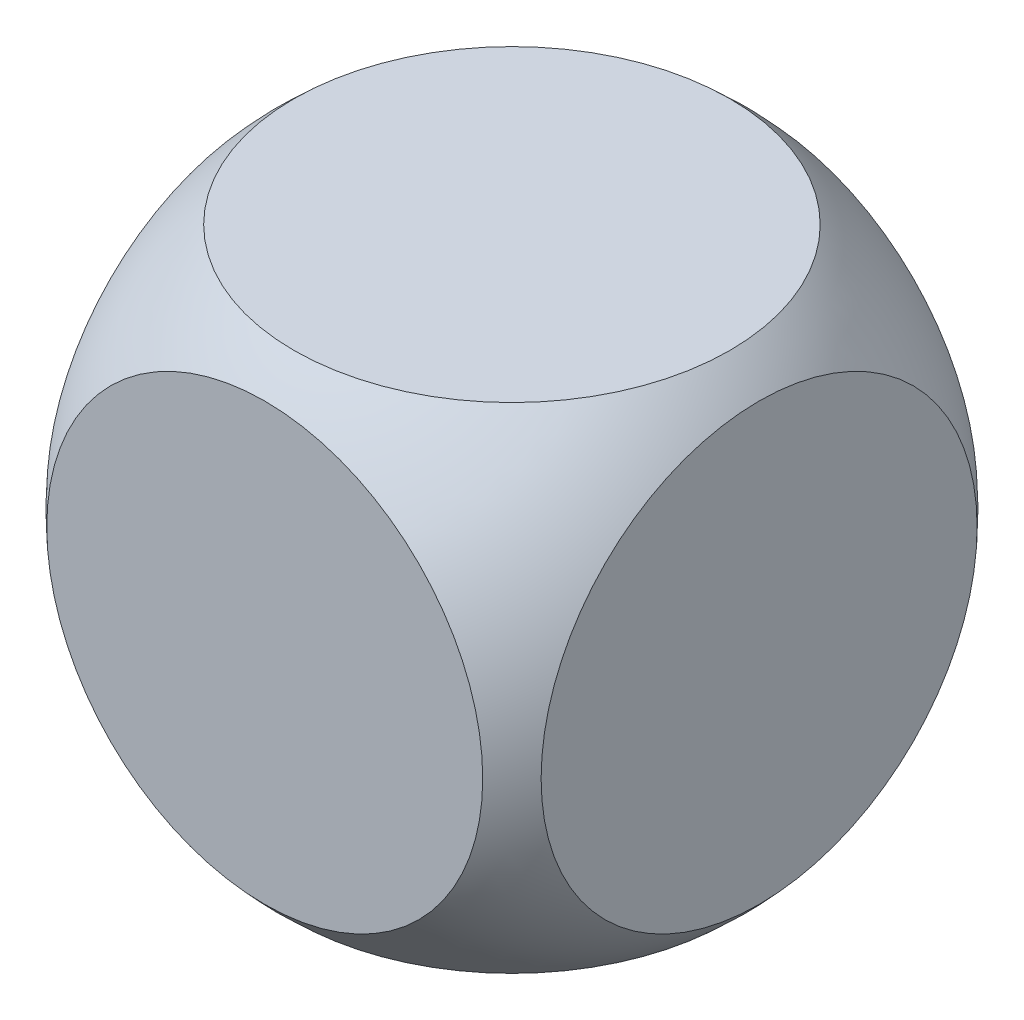
ISO-10303-21;
HEADER;
FILE_DESCRIPTION(('STEP AP214'),'2;1');
FILE_NAME('part.step','',(''),(''),'','','');
FILE_SCHEMA(('AUTOMOTIVE_DESIGN { 1 0 10303 214 1 1 1 1 }'));
ENDSEC;
DATA;
#1=APPLICATION_CONTEXT('core data for automotive mechanical design processes');
#2=APPLICATION_PROTOCOL_DEFINITION('international standard','automotive_design',2000,#1);
#3=PRODUCT_CONTEXT('',#1,'mechanical');
#4=PRODUCT('Part','Part','',(#3));
#5=PRODUCT_RELATED_PRODUCT_CATEGORY('part','',(#4));
#6=PRODUCT_DEFINITION_FORMATION('','',#4);
#7=PRODUCT_DEFINITION_CONTEXT('part definition',#1,'design');
#8=PRODUCT_DEFINITION('design','',#6,#7);
#9=PRODUCT_DEFINITION_SHAPE('','',#8);
#10=(LENGTH_UNIT() NAMED_UNIT(*) SI_UNIT(.MILLI.,.METRE.));
#11=(NAMED_UNIT(*) PLANE_ANGLE_UNIT() SI_UNIT($,.RADIAN.));
#12=(NAMED_UNIT(*) SI_UNIT($,.STERADIAN.) SOLID_ANGLE_UNIT());
#13=UNCERTAINTY_MEASURE_WITH_UNIT(LENGTH_MEASURE(1.E-05),#10,'distance_accuracy_value','');
#14=(GEOMETRIC_REPRESENTATION_CONTEXT(3) GLOBAL_UNCERTAINTY_ASSIGNED_CONTEXT((#13)) GLOBAL_UNIT_ASSIGNED_CONTEXT((#10,
#11,#12)) REPRESENTATION_CONTEXT('',''));
#15=CARTESIAN_POINT('',(0.,0.,0.));
#16=DIRECTION('',(0.,0.,1.));
#17=DIRECTION('',(1.,0.,0.));
#18=AXIS2_PLACEMENT_3D('',#15,#16,#17);
#19=CARTESIAN_POINT('',(-30.,30.,-30.));
#20=DIRECTION('',(-1.,0.,0.));
#21=DIRECTION('',(0.,-1.,0.));
#22=AXIS2_PLACEMENT_3D('',#19,#20,#21);
#23=PLANE('',#22);
#24=CARTESIAN_POINT('',(-30.,0.,0.));
#25=DIRECTION('',(-1.,0.,0.));
#26=DIRECTION('',(0.,-1.,0.));
#27=AXIS2_PLACEMENT_3D('',#24,#25,#26);
#28=CIRCLE('',#27,26.4575131106459);
#29=CARTESIAN_POINT('',(-30.,-26.4575131106459,0.));
#30=VERTEX_POINT('',#29);
#31=EDGE_CURVE('E10',#30,#30,#28,.F.);
#32=ORIENTED_EDGE('',*,*,#31,.F.);
#33=EDGE_LOOP('',(#32));
#34=FACE_BOUND('',#33,.T.);
#35=ADVANCED_FACE('F33',(#34),#23,.T.);
#36=CARTESIAN_POINT('',(-30.,30.,-30.));
#37=DIRECTION('',(0.,1.,0.));
#38=DIRECTION('',(0.,0.,1.));
#39=AXIS2_PLACEMENT_3D('',#36,#37,#38);
#40=PLANE('',#39);
#41=CARTESIAN_POINT('',(0.,30.,0.));
#42=DIRECTION('',(0.,1.,0.));
#43=DIRECTION('',(0.,0.,1.));
#44=AXIS2_PLACEMENT_3D('',#41,#42,#43);
#45=CIRCLE('',#44,26.4575131106459);
#46=CARTESIAN_POINT('',(0.,30.,26.4575131106459));
#47=VERTEX_POINT('',#46);
#48=EDGE_CURVE('E41',#47,#47,#45,.F.);
#49=ORIENTED_EDGE('',*,*,#48,.F.);
#50=EDGE_LOOP('',(#49));
#51=FACE_BOUND('',#50,.T.);
#52=ADVANCED_FACE('F65',(#51),#40,.T.);
#53=CARTESIAN_POINT('',(30.,30.,-30.));
#54=DIRECTION('',(1.,0.,0.));
#55=DIRECTION('',(0.,1.,0.));
#56=AXIS2_PLACEMENT_3D('',#53,#54,#55);
#57=PLANE('',#56);
#58=CARTESIAN_POINT('',(30.,0.,0.));
#59=DIRECTION('',(1.,0.,0.));
#60=DIRECTION('',(0.,1.,0.));
#61=AXIS2_PLACEMENT_3D('',#58,#59,#60);
#62=CIRCLE('',#61,26.4575131106459);
#63=CARTESIAN_POINT('',(30.,26.4575131106459,0.));
#64=VERTEX_POINT('',#63);
#65=EDGE_CURVE('E46',#64,#64,#62,.F.);
#66=ORIENTED_EDGE('',*,*,#65,.F.);
#67=EDGE_LOOP('',(#66));
#68=FACE_BOUND('',#67,.T.);
#69=ADVANCED_FACE('F71',(#68),#57,.T.);
#70=CARTESIAN_POINT('',(-30.,-30.,-30.));
#71=DIRECTION('',(0.,-1.,0.));
#72=DIRECTION('',(0.,0.,-1.));
#73=AXIS2_PLACEMENT_3D('',#70,#71,#72);
#74=PLANE('',#73);
#75=CARTESIAN_POINT('',(0.,-30.,0.));
#76=DIRECTION('',(0.,-1.,0.));
#77=DIRECTION('',(0.,0.,-1.));
#78=AXIS2_PLACEMENT_3D('',#75,#76,#77);
#79=CIRCLE('',#78,26.4575131106459);
#80=CARTESIAN_POINT('',(0.,-30.,-26.4575131106459));
#81=VERTEX_POINT('',#80);
#82=EDGE_CURVE('E51',#81,#81,#79,.F.);
#83=ORIENTED_EDGE('',*,*,#82,.F.);
#84=EDGE_LOOP('',(#83));
#85=FACE_BOUND('',#84,.T.);
#86=ADVANCED_FACE('F73',(#85),#74,.T.);
#87=CARTESIAN_POINT('',(0.,0.,-30.));
#88=DIRECTION('',(0.,0.,1.));
#89=DIRECTION('',(1.,0.,0.));
#90=AXIS2_PLACEMENT_3D('',#87,#88,#89);
#91=PLANE('',#90);
#92=CARTESIAN_POINT('',(0.,0.,-30.));
#93=DIRECTION('',(0.,0.,1.));
#94=DIRECTION('',(1.,0.,0.));
#95=AXIS2_PLACEMENT_3D('',#92,#93,#94);
#96=CIRCLE('',#95,26.4575131106459);
#97=CARTESIAN_POINT('',(26.4575131106459,0.,-30.));
#98=VERTEX_POINT('',#97);
#99=EDGE_CURVE('E37',#98,#98,#96,.F.);
#100=ORIENTED_EDGE('',*,*,#99,.T.);
#101=EDGE_LOOP('',(#100));
#102=FACE_BOUND('',#101,.T.);
#103=ADVANCED_FACE('F60',(#102),#91,.F.);
#104=CARTESIAN_POINT('',(0.,0.,0.));
#105=DIRECTION('',(0.,-1.,0.));
#106=DIRECTION('',(-1.,0.,0.));
#107=AXIS2_PLACEMENT_3D('',#104,#105,#106);
#108=SPHERICAL_SURFACE('',#107,40.);
#109=ORIENTED_EDGE('',*,*,#31,.T.);
#110=EDGE_LOOP('',(#109));
#111=FACE_BOUND('',#110,.T.);
#112=ORIENTED_EDGE('',*,*,#65,.T.);
#113=EDGE_LOOP('',(#112));
#114=FACE_BOUND('',#113,.T.);
#115=CARTESIAN_POINT('',(0.,0.,30.));
#116=DIRECTION('',(0.,0.,1.));
#117=DIRECTION('',(1.,0.,0.));
#118=AXIS2_PLACEMENT_3D('',#115,#116,#117);
#119=CIRCLE('',#118,26.4575131106459);
#120=CARTESIAN_POINT('',(26.4575131106459,0.,30.));
#121=VERTEX_POINT('',#120);
#122=EDGE_CURVE('E53',#121,#121,#119,.F.);
#123=ORIENTED_EDGE('',*,*,#122,.T.);
#124=EDGE_LOOP('',(#123));
#125=FACE_BOUND('',#124,.T.);
#126=ORIENTED_EDGE('',*,*,#99,.F.);
#127=EDGE_LOOP('',(#126));
#128=FACE_BOUND('',#127,.T.);
#129=ORIENTED_EDGE('',*,*,#82,.T.);
#130=EDGE_LOOP('',(#129));
#131=FACE_BOUND('',#130,.T.);
#132=ORIENTED_EDGE('',*,*,#48,.T.);
#133=EDGE_LOOP('',(#132));
#134=FACE_BOUND('',#133,.T.);
#135=ADVANCED_FACE('F35',(#111,#114,#125,#128,#131,#134),#108,.T.);
#136=CARTESIAN_POINT('',(0.,0.,30.));
#137=DIRECTION('',(0.,0.,1.));
#138=DIRECTION('',(1.,0.,0.));
#139=AXIS2_PLACEMENT_3D('',#136,#137,#138);
#140=PLANE('',#139);
#141=ORIENTED_EDGE('',*,*,#122,.F.);
#142=EDGE_LOOP('',(#141));
#143=FACE_BOUND('',#142,.T.);
#144=ADVANCED_FACE('F64',(#143),#140,.T.);
#145=CLOSED_SHELL('',(#35,#52,#69,#86,#103,#135,#144));
#146=MANIFOLD_SOLID_BREP('B2',#145);
#147=ADVANCED_BREP_SHAPE_REPRESENTATION('',(#18,#146),#14);
#148=SHAPE_DEFINITION_REPRESENTATION(#9,#147);
ENDSEC;
END-ISO-10303-21;
